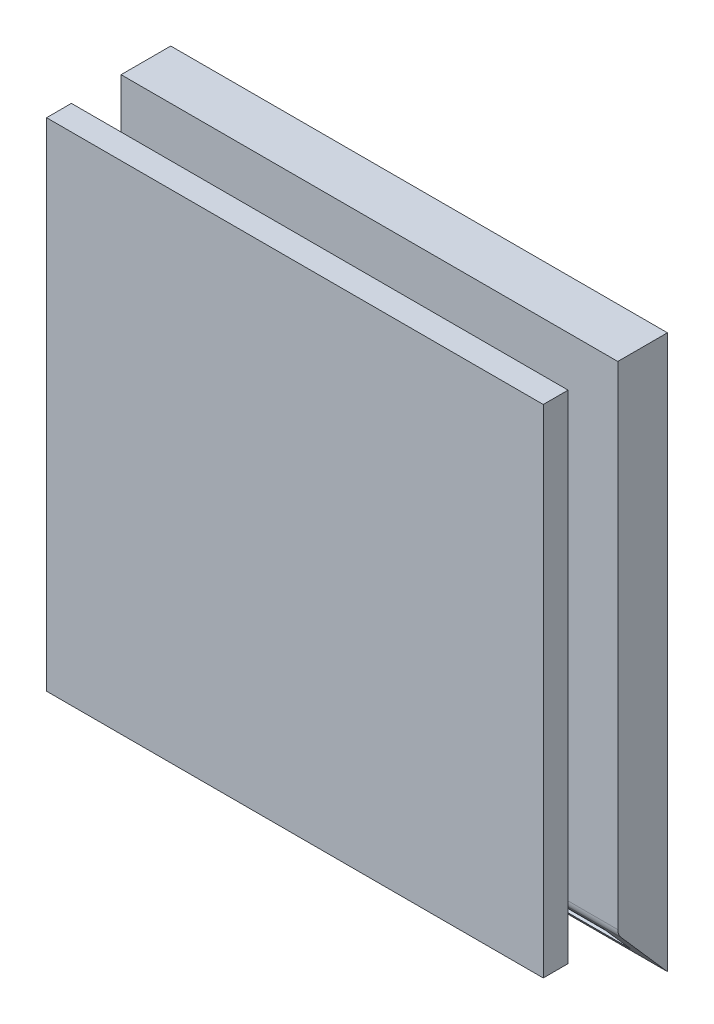
ISO-10303-21;
HEADER;
FILE_DESCRIPTION(('STEP AP214'),'2;1');
FILE_NAME('part.step','',(''),(''),'','','');
FILE_SCHEMA(('AUTOMOTIVE_DESIGN { 1 0 10303 214 1 1 1 1 }'));
ENDSEC;
DATA;
#1=APPLICATION_CONTEXT('core data for automotive mechanical design processes');
#2=APPLICATION_PROTOCOL_DEFINITION('international standard','automotive_design',2000,#1);
#3=PRODUCT_CONTEXT('',#1,'mechanical');
#4=PRODUCT('Part','Part','',(#3));
#5=PRODUCT_RELATED_PRODUCT_CATEGORY('part','',(#4));
#6=PRODUCT_DEFINITION_FORMATION('','',#4);
#7=PRODUCT_DEFINITION_CONTEXT('part definition',#1,'design');
#8=PRODUCT_DEFINITION('design','',#6,#7);
#9=PRODUCT_DEFINITION_SHAPE('','',#8);
#10=(LENGTH_UNIT() NAMED_UNIT(*) SI_UNIT(.MILLI.,.METRE.));
#11=(NAMED_UNIT(*) PLANE_ANGLE_UNIT() SI_UNIT($,.RADIAN.));
#12=(NAMED_UNIT(*) SI_UNIT($,.STERADIAN.) SOLID_ANGLE_UNIT());
#13=UNCERTAINTY_MEASURE_WITH_UNIT(LENGTH_MEASURE(1.E-05),#10,'distance_accuracy_value','');
#14=(GEOMETRIC_REPRESENTATION_CONTEXT(3) GLOBAL_UNCERTAINTY_ASSIGNED_CONTEXT((#13)) GLOBAL_UNIT_ASSIGNED_CONTEXT((#10,
#11,#12)) REPRESENTATION_CONTEXT('',''));
#15=CARTESIAN_POINT('',(0.,0.,0.));
#16=DIRECTION('',(0.,0.,1.));
#17=DIRECTION('',(1.,0.,0.));
#18=AXIS2_PLACEMENT_3D('',#15,#16,#17);
#19=CARTESIAN_POINT('',(8522.17142691417,-2176.82611696061,50.));
#20=DIRECTION('',(0.,1.,0.));
#21=DIRECTION('',(0.,0.,1.));
#22=AXIS2_PLACEMENT_3D('',#19,#20,#21);
#23=PLANE('',#22);
#24=DIRECTION('',(0.,0.,-1.));
#25=VECTOR('',#24,1.);
#26=CARTESIAN_POINT('',(8682.17142691417,-2176.82611696061,30.));
#27=LINE('',#26,#25);
#28=CARTESIAN_POINT('',(8682.17142691417,-2176.82611696061,40.));
#29=VERTEX_POINT('',#28);
#30=CARTESIAN_POINT('',(8682.17142691417,-2176.82611696061,20.));
#31=VERTEX_POINT('',#30);
#32=EDGE_CURVE('E36',#29,#31,#27,.T.);
#33=ORIENTED_EDGE('',*,*,#32,.T.);
#34=DIRECTION('',(-1.,0.,0.));
#35=VECTOR('',#34,1.);
#36=CARTESIAN_POINT('',(8602.17142691417,-2176.82611696061,20.));
#37=LINE('',#36,#35);
#38=CARTESIAN_POINT('',(8522.17142691417,-2176.82611696061,20.));
#39=VERTEX_POINT('',#38);
#40=EDGE_CURVE('E219',#31,#39,#37,.T.);
#41=ORIENTED_EDGE('',*,*,#40,.T.);
#42=DIRECTION('',(0.,0.,-1.));
#43=VECTOR('',#42,1.);
#44=CARTESIAN_POINT('',(8522.17142691417,-2176.82611696061,30.));
#45=LINE('',#44,#43);
#46=CARTESIAN_POINT('',(8522.17142691417,-2176.82611696061,40.));
#47=VERTEX_POINT('',#46);
#48=EDGE_CURVE('E27',#47,#39,#45,.T.);
#49=ORIENTED_EDGE('',*,*,#48,.F.);
#50=DIRECTION('',(-1.,0.,0.));
#51=VECTOR('',#50,1.);
#52=CARTESIAN_POINT('',(8602.17142691417,-2176.82611696061,40.));
#53=LINE('',#52,#51);
#54=EDGE_CURVE('E10',#29,#47,#53,.T.);
#55=ORIENTED_EDGE('',*,*,#54,.F.);
#56=EDGE_LOOP('',(#33,#41,#49,#55));
#57=FACE_BOUND('',#56,.T.);
#58=ADVANCED_FACE('F16',(#57),#23,.T.);
#59=CARTESIAN_POINT('',(8682.17142691417,-2336.82611696061,50.));
#60=DIRECTION('',(-1.,0.,0.));
#61=DIRECTION('',(0.,0.,1.));
#62=AXIS2_PLACEMENT_3D('',#59,#60,#61);
#63=PLANE('',#62);
#64=DIRECTION('',(0.,0.,-1.));
#65=VECTOR('',#64,1.);
#66=CARTESIAN_POINT('',(8682.17142691417,-2336.82611696061,30.));
#67=LINE('',#66,#65);
#68=CARTESIAN_POINT('',(8682.17142691417,-2336.82611696061,40.));
#69=VERTEX_POINT('',#68);
#70=CARTESIAN_POINT('',(8682.17142691417,-2336.82611696061,20.));
#71=VERTEX_POINT('',#70);
#72=EDGE_CURVE('E305',#69,#71,#67,.T.);
#73=ORIENTED_EDGE('',*,*,#72,.T.);
#74=DIRECTION('',(0.,1.,0.));
#75=VECTOR('',#74,1.);
#76=CARTESIAN_POINT('',(8682.17142691417,-2256.82611696061,20.));
#77=LINE('',#76,#75);
#78=EDGE_CURVE('E309',#71,#31,#77,.T.);
#79=ORIENTED_EDGE('',*,*,#78,.T.);
#80=ORIENTED_EDGE('',*,*,#32,.F.);
#81=DIRECTION('',(0.,1.,0.));
#82=VECTOR('',#81,1.);
#83=CARTESIAN_POINT('',(8682.17142691417,-2256.82611696061,40.));
#84=LINE('',#83,#82);
#85=EDGE_CURVE('E319',#69,#29,#84,.T.);
#86=ORIENTED_EDGE('',*,*,#85,.F.);
#87=EDGE_LOOP('',(#73,#79,#80,#86));
#88=FACE_BOUND('',#87,.T.);
#89=ADVANCED_FACE('F333',(#88),#63,.F.);
#90=CARTESIAN_POINT('',(8682.17142691417,-2336.82611696061,50.));
#91=DIRECTION('',(0.,-1.,0.));
#92=DIRECTION('',(0.,0.,-1.));
#93=AXIS2_PLACEMENT_3D('',#90,#91,#92);
#94=PLANE('',#93);
#95=DIRECTION('',(0.,0.,-1.));
#96=VECTOR('',#95,1.);
#97=CARTESIAN_POINT('',(8522.17142691417,-2336.82611696061,30.));
#98=LINE('',#97,#96);
#99=CARTESIAN_POINT('',(8522.17142691417,-2336.82611696061,40.));
#100=VERTEX_POINT('',#99);
#101=CARTESIAN_POINT('',(8522.17142691417,-2336.82611696061,20.));
#102=VERTEX_POINT('',#101);
#103=EDGE_CURVE('E294',#100,#102,#98,.T.);
#104=ORIENTED_EDGE('',*,*,#103,.T.);
#105=DIRECTION('',(1.,0.,0.));
#106=VECTOR('',#105,1.);
#107=CARTESIAN_POINT('',(8602.17142691417,-2336.82611696061,20.));
#108=LINE('',#107,#106);
#109=EDGE_CURVE('E300',#102,#71,#108,.T.);
#110=ORIENTED_EDGE('',*,*,#109,.T.);
#111=ORIENTED_EDGE('',*,*,#72,.F.);
#112=DIRECTION('',(1.,0.,0.));
#113=VECTOR('',#112,1.);
#114=CARTESIAN_POINT('',(8602.17142691417,-2336.82611696061,40.));
#115=LINE('',#114,#113);
#116=EDGE_CURVE('E310',#100,#69,#115,.T.);
#117=ORIENTED_EDGE('',*,*,#116,.F.);
#118=EDGE_LOOP('',(#104,#110,#111,#117));
#119=FACE_BOUND('',#118,.T.);
#120=ADVANCED_FACE('F344',(#119),#94,.T.);
#121=CARTESIAN_POINT('',(8522.17142691417,-2176.82611696061,50.));
#122=DIRECTION('',(1.,0.,0.));
#123=DIRECTION('',(0.,0.,-1.));
#124=AXIS2_PLACEMENT_3D('',#121,#122,#123);
#125=PLANE('',#124);
#126=ORIENTED_EDGE('',*,*,#48,.T.);
#127=DIRECTION('',(0.,-1.,0.));
#128=VECTOR('',#127,1.);
#129=CARTESIAN_POINT('',(8522.17142691417,-2256.82611696061,20.));
#130=LINE('',#129,#128);
#131=EDGE_CURVE('E233',#39,#102,#130,.T.);
#132=ORIENTED_EDGE('',*,*,#131,.T.);
#133=ORIENTED_EDGE('',*,*,#103,.F.);
#134=DIRECTION('',(0.,-1.,0.));
#135=VECTOR('',#134,1.);
#136=CARTESIAN_POINT('',(8522.17142691417,-2256.82611696061,40.));
#137=LINE('',#136,#135);
#138=EDGE_CURVE('E301',#47,#100,#137,.T.);
#139=ORIENTED_EDGE('',*,*,#138,.F.);
#140=EDGE_LOOP('',(#126,#132,#133,#139));
#141=FACE_BOUND('',#140,.T.);
#142=ADVANCED_FACE('F338',(#141),#125,.F.);
#143=CARTESIAN_POINT('',(0.,0.,40.));
#144=DIRECTION('',(0.,0.,1.));
#145=DIRECTION('',(1.,0.,0.));
#146=AXIS2_PLACEMENT_3D('',#143,#144,#145);
#147=PLANE('',#146);
#148=DIRECTION('',(1.,0.,0.));
#149=VECTOR('',#148,1.);
#150=CARTESIAN_POINT('',(8602.17142691417,-2156.8261169606,40.));
#151=LINE('',#150,#149);
#152=CARTESIAN_POINT('',(8502.17142691417,-2156.8261169606,40.));
#153=VERTEX_POINT('',#152);
#154=CARTESIAN_POINT('',(8702.17142691417,-2156.8261169606,40.));
#155=VERTEX_POINT('',#154);
#156=EDGE_CURVE('E275',#153,#155,#151,.T.);
#157=ORIENTED_EDGE('',*,*,#156,.T.);
#158=DIRECTION('',(0.,1.,0.));
#159=VECTOR('',#158,1.);
#160=CARTESIAN_POINT('',(8702.17142691417,-2256.8261169606,40.));
#161=LINE('',#160,#159);
#162=CARTESIAN_POINT('',(8702.17142691417,-2356.8261169606,40.));
#163=VERTEX_POINT('',#162);
#164=EDGE_CURVE('E284',#163,#155,#161,.T.);
#165=ORIENTED_EDGE('',*,*,#164,.F.);
#166=DIRECTION('',(-1.,0.,0.));
#167=VECTOR('',#166,1.);
#168=CARTESIAN_POINT('',(8602.17142691417,-2356.8261169606,40.));
#169=LINE('',#168,#167);
#170=CARTESIAN_POINT('',(8502.17142691417,-2356.8261169606,40.));
#171=VERTEX_POINT('',#170);
#172=EDGE_CURVE('E260',#163,#171,#169,.T.);
#173=ORIENTED_EDGE('',*,*,#172,.T.);
#174=DIRECTION('',(0.,-1.,0.));
#175=VECTOR('',#174,1.);
#176=CARTESIAN_POINT('',(8502.17142691417,-2256.8261169606,40.));
#177=LINE('',#176,#175);
#178=EDGE_CURVE('E288',#153,#171,#177,.T.);
#179=ORIENTED_EDGE('',*,*,#178,.F.);
#180=EDGE_LOOP('',(#157,#165,#173,#179));
#181=FACE_BOUND('',#180,.T.);
#182=ORIENTED_EDGE('',*,*,#54,.T.);
#183=ORIENTED_EDGE('',*,*,#138,.T.);
#184=ORIENTED_EDGE('',*,*,#116,.T.);
#185=ORIENTED_EDGE('',*,*,#85,.T.);
#186=EDGE_LOOP('',(#182,#183,#184,#185));
#187=FACE_BOUND('',#186,.T.);
#188=ADVANCED_FACE('F342',(#181,#187),#147,.F.);
#189=CARTESIAN_POINT('',(8502.17142691417,-2156.8261169606,0.));
#190=DIRECTION('',(0.,-1.,0.));
#191=DIRECTION('',(0.,0.,-1.));
#192=AXIS2_PLACEMENT_3D('',#189,#190,#191);
#193=PLANE('',#192);
#194=DIRECTION('',(0.,0.,1.));
#195=VECTOR('',#194,1.);
#196=CARTESIAN_POINT('',(8702.17142691417,-2156.8261169606,45.));
#197=LINE('',#196,#195);
#198=CARTESIAN_POINT('',(8702.17142691417,-2156.8261169606,50.));
#199=VERTEX_POINT('',#198);
#200=EDGE_CURVE('E280',#155,#199,#197,.T.);
#201=ORIENTED_EDGE('',*,*,#200,.F.);
#202=ORIENTED_EDGE('',*,*,#156,.F.);
#203=DIRECTION('',(0.,0.,1.));
#204=VECTOR('',#203,1.);
#205=CARTESIAN_POINT('',(8502.17142691417,-2156.8261169606,45.));
#206=LINE('',#205,#204);
#207=CARTESIAN_POINT('',(8502.17142691417,-2156.8261169606,50.));
#208=VERTEX_POINT('',#207);
#209=EDGE_CURVE('E272',#153,#208,#206,.T.);
#210=ORIENTED_EDGE('',*,*,#209,.T.);
#211=DIRECTION('',(-1.,0.,0.));
#212=VECTOR('',#211,1.);
#213=CARTESIAN_POINT('',(8602.17142691417,-2156.8261169606,50.));
#214=LINE('',#213,#212);
#215=EDGE_CURVE('E276',#199,#208,#214,.T.);
#216=ORIENTED_EDGE('',*,*,#215,.F.);
#217=EDGE_LOOP('',(#201,#202,#210,#216));
#218=FACE_BOUND('',#217,.T.);
#219=ADVANCED_FACE('F385',(#218),#193,.F.);
#220=CARTESIAN_POINT('',(8502.17142691417,-2156.8261169606,0.));
#221=DIRECTION('',(-1.,0.,0.));
#222=DIRECTION('',(0.,0.,1.));
#223=AXIS2_PLACEMENT_3D('',#220,#221,#222);
#224=PLANE('',#223);
#225=ORIENTED_EDGE('',*,*,#178,.T.);
#226=DIRECTION('',(0.,0.,1.));
#227=VECTOR('',#226,1.);
#228=CARTESIAN_POINT('',(8502.17142691417,-2356.8261169606,45.));
#229=LINE('',#228,#227);
#230=CARTESIAN_POINT('',(8502.17142691417,-2356.8261169606,50.));
#231=VERTEX_POINT('',#230);
#232=EDGE_CURVE('E265',#171,#231,#229,.T.);
#233=ORIENTED_EDGE('',*,*,#232,.T.);
#234=DIRECTION('',(0.,-1.,0.));
#235=VECTOR('',#234,1.);
#236=CARTESIAN_POINT('',(8502.17142691417,-2256.8261169606,50.));
#237=LINE('',#236,#235);
#238=EDGE_CURVE('E268',#208,#231,#237,.T.);
#239=ORIENTED_EDGE('',*,*,#238,.F.);
#240=ORIENTED_EDGE('',*,*,#209,.F.);
#241=EDGE_LOOP('',(#225,#233,#239,#240));
#242=FACE_BOUND('',#241,.T.);
#243=ADVANCED_FACE('F394',(#242),#224,.T.);
#244=CARTESIAN_POINT('',(8702.17142691417,-2356.8261169606,0.));
#245=DIRECTION('',(0.,1.,0.));
#246=DIRECTION('',(0.,0.,1.));
#247=AXIS2_PLACEMENT_3D('',#244,#245,#246);
#248=PLANE('',#247);
#249=ORIENTED_EDGE('',*,*,#232,.F.);
#250=ORIENTED_EDGE('',*,*,#172,.F.);
#251=DIRECTION('',(0.,0.,1.));
#252=VECTOR('',#251,1.);
#253=CARTESIAN_POINT('',(8702.17142691417,-2356.8261169606,45.));
#254=LINE('',#253,#252);
#255=CARTESIAN_POINT('',(8702.17142691417,-2356.8261169606,50.));
#256=VERTEX_POINT('',#255);
#257=EDGE_CURVE('E257',#163,#256,#254,.T.);
#258=ORIENTED_EDGE('',*,*,#257,.T.);
#259=DIRECTION('',(1.,0.,0.));
#260=VECTOR('',#259,1.);
#261=CARTESIAN_POINT('',(8602.17142691417,-2356.8261169606,50.));
#262=LINE('',#261,#260);
#263=EDGE_CURVE('E261',#231,#256,#262,.T.);
#264=ORIENTED_EDGE('',*,*,#263,.F.);
#265=EDGE_LOOP('',(#249,#250,#258,#264));
#266=FACE_BOUND('',#265,.T.);
#267=ADVANCED_FACE('F403',(#266),#248,.F.);
#268=CARTESIAN_POINT('',(8702.17142691417,-2356.8261169606,0.));
#269=DIRECTION('',(1.,0.,0.));
#270=DIRECTION('',(0.,0.,-1.));
#271=AXIS2_PLACEMENT_3D('',#268,#269,#270);
#272=PLANE('',#271);
#273=ORIENTED_EDGE('',*,*,#164,.T.);
#274=ORIENTED_EDGE('',*,*,#200,.T.);
#275=DIRECTION('',(0.,1.,0.));
#276=VECTOR('',#275,1.);
#277=CARTESIAN_POINT('',(8702.17142691417,-2256.8261169606,50.));
#278=LINE('',#277,#276);
#279=EDGE_CURVE('E251',#256,#199,#278,.T.);
#280=ORIENTED_EDGE('',*,*,#279,.F.);
#281=ORIENTED_EDGE('',*,*,#257,.F.);
#282=EDGE_LOOP('',(#273,#274,#280,#281));
#283=FACE_BOUND('',#282,.T.);
#284=ADVANCED_FACE('F412',(#283),#272,.T.);
#285=CARTESIAN_POINT('',(0.,0.,50.));
#286=DIRECTION('',(0.,0.,1.));
#287=DIRECTION('',(1.,0.,0.));
#288=AXIS2_PLACEMENT_3D('',#285,#286,#287);
#289=PLANE('',#288);
#290=ORIENTED_EDGE('',*,*,#215,.T.);
#291=ORIENTED_EDGE('',*,*,#238,.T.);
#292=ORIENTED_EDGE('',*,*,#263,.T.);
#293=ORIENTED_EDGE('',*,*,#279,.T.);
#294=EDGE_LOOP('',(#290,#291,#292,#293));
#295=FACE_BOUND('',#294,.T.);
#296=ADVANCED_FACE('F421',(#295),#289,.T.);
#297=CARTESIAN_POINT('',(0.,0.,0.));
#298=DIRECTION('',(0.,0.,1.));
#299=DIRECTION('',(1.,0.,0.));
#300=AXIS2_PLACEMENT_3D('',#297,#298,#299);
#301=PLANE('',#300);
#302=DIRECTION('',(-1.,0.,0.));
#303=VECTOR('',#302,1.);
#304=CARTESIAN_POINT('',(8602.17142691417,-2379.6068227965,0.));
#305=LINE('',#304,#303);
#306=CARTESIAN_POINT('',(8702.17142691417,-2379.6068227965,0.));
#307=VERTEX_POINT('',#306);
#308=CARTESIAN_POINT('',(8502.17142691417,-2379.6068227965,0.));
#309=VERTEX_POINT('',#308);
#310=EDGE_CURVE('E195',#307,#309,#305,.T.);
#311=ORIENTED_EDGE('',*,*,#310,.T.);
#312=DIRECTION('',(0.,-1.,0.));
#313=VECTOR('',#312,1.);
#314=CARTESIAN_POINT('',(8502.17142691417,-2268.21646987855,0.));
#315=LINE('',#314,#313);
#316=CARTESIAN_POINT('',(8502.17142691417,-2156.8261169606,0.));
#317=VERTEX_POINT('',#316);
#318=EDGE_CURVE('E237',#317,#309,#315,.T.);
#319=ORIENTED_EDGE('',*,*,#318,.F.);
#320=DIRECTION('',(-1.,0.,0.));
#321=VECTOR('',#320,1.);
#322=CARTESIAN_POINT('',(8602.17142691417,-2156.8261169606,0.));
#323=LINE('',#322,#321);
#324=CARTESIAN_POINT('',(8702.17142691417,-2156.8261169606,0.));
#325=VERTEX_POINT('',#324);
#326=EDGE_CURVE('E243',#325,#317,#323,.T.);
#327=ORIENTED_EDGE('',*,*,#326,.F.);
#328=DIRECTION('',(0.,1.,0.));
#329=VECTOR('',#328,1.);
#330=CARTESIAN_POINT('',(8702.17142691417,-2268.21646987855,0.));
#331=LINE('',#330,#329);
#332=EDGE_CURVE('E247',#307,#325,#331,.T.);
#333=ORIENTED_EDGE('',*,*,#332,.F.);
#334=EDGE_LOOP('',(#311,#319,#327,#333));
#335=FACE_BOUND('',#334,.T.);
#336=ADVANCED_FACE('F430',(#335),#301,.F.);
#337=CARTESIAN_POINT('',(8502.17142691417,-2156.8261169606,0.));
#338=DIRECTION('',(0.,-1.,0.));
#339=DIRECTION('',(0.,0.,-1.));
#340=AXIS2_PLACEMENT_3D('',#337,#338,#339);
#341=PLANE('',#340);
#342=DIRECTION('',(0.,0.,1.));
#343=VECTOR('',#342,1.);
#344=CARTESIAN_POINT('',(8502.17142691417,-2156.8261169606,10.));
#345=LINE('',#344,#343);
#346=CARTESIAN_POINT('',(8502.17142691417,-2156.8261169606,20.));
#347=VERTEX_POINT('',#346);
#348=EDGE_CURVE('E215',#317,#347,#345,.T.);
#349=ORIENTED_EDGE('',*,*,#348,.T.);
#350=DIRECTION('',(1.,0.,0.));
#351=VECTOR('',#350,1.);
#352=CARTESIAN_POINT('',(8602.17142691417,-2156.8261169606,20.));
#353=LINE('',#352,#351);
#354=CARTESIAN_POINT('',(8702.17142691417,-2156.8261169606,20.));
#355=VERTEX_POINT('',#354);
#356=EDGE_CURVE('E230',#347,#355,#353,.T.);
#357=ORIENTED_EDGE('',*,*,#356,.T.);
#358=DIRECTION('',(0.,0.,1.));
#359=VECTOR('',#358,1.);
#360=CARTESIAN_POINT('',(8702.17142691417,-2156.8261169606,10.));
#361=LINE('',#360,#359);
#362=EDGE_CURVE('E229',#325,#355,#361,.T.);
#363=ORIENTED_EDGE('',*,*,#362,.F.);
#364=ORIENTED_EDGE('',*,*,#326,.T.);
#365=EDGE_LOOP('',(#349,#357,#363,#364));
#366=FACE_BOUND('',#365,.T.);
#367=ADVANCED_FACE('F439',(#366),#341,.F.);
#368=CARTESIAN_POINT('',(0.,0.,20.));
#369=DIRECTION('',(0.,0.,1.));
#370=DIRECTION('',(1.,0.,0.));
#371=AXIS2_PLACEMENT_3D('',#368,#369,#370);
#372=PLANE('',#371);
#373=DIRECTION('',(-1.,0.,0.));
#374=VECTOR('',#373,1.);
#375=CARTESIAN_POINT('',(8602.17142691417,-2354.94270285808,20.));
#376=LINE('',#375,#374);
#377=CARTESIAN_POINT('',(8702.17142691417,-2354.94270285808,20.));
#378=VERTEX_POINT('',#377);
#379=CARTESIAN_POINT('',(8502.17142691417,-2354.94270285808,20.));
#380=VERTEX_POINT('',#379);
#381=EDGE_CURVE('E225',#378,#380,#376,.T.);
#382=ORIENTED_EDGE('',*,*,#381,.F.);
#383=DIRECTION('',(0.,1.,0.));
#384=VECTOR('',#383,1.);
#385=CARTESIAN_POINT('',(8702.17142691417,-2255.88440990934,20.));
#386=LINE('',#385,#384);
#387=EDGE_CURVE('E200',#378,#355,#386,.T.);
#388=ORIENTED_EDGE('',*,*,#387,.T.);
#389=ORIENTED_EDGE('',*,*,#356,.F.);
#390=DIRECTION('',(0.,-1.,0.));
#391=VECTOR('',#390,1.);
#392=CARTESIAN_POINT('',(8502.17142691417,-2255.88440990934,20.));
#393=LINE('',#392,#391);
#394=EDGE_CURVE('E209',#347,#380,#393,.T.);
#395=ORIENTED_EDGE('',*,*,#394,.T.);
#396=EDGE_LOOP('',(#382,#388,#389,#395));
#397=FACE_BOUND('',#396,.T.);
#398=ORIENTED_EDGE('',*,*,#131,.F.);
#399=ORIENTED_EDGE('',*,*,#40,.F.);
#400=ORIENTED_EDGE('',*,*,#78,.F.);
#401=ORIENTED_EDGE('',*,*,#109,.F.);
#402=EDGE_LOOP('',(#398,#399,#400,#401));
#403=FACE_BOUND('',#402,.T.);
#404=ADVANCED_FACE('F336',(#397,#403),#372,.T.);
#405=CARTESIAN_POINT('',(8502.17142691417,-2156.8261169606,0.));
#406=DIRECTION('',(-1.,0.,0.));
#407=DIRECTION('',(0.,0.,1.));
#408=AXIS2_PLACEMENT_3D('',#405,#406,#407);
#409=PLANE('',#408);
#410=CARTESIAN_POINT('',(8502.17142691417,-2354.94270285808,15.));
#411=DIRECTION('',(1.,0.,0.));
#412=DIRECTION('',(0.,0.,1.));
#413=AXIS2_PLACEMENT_3D('',#410,#411,#412);
#414=CIRCLE('',#413,5.);
#415=CARTESIAN_POINT('',(8502.17142691417,-2358.24146927079,18.7574113634707));
#416=VERTEX_POINT('',#415);
#417=EDGE_CURVE('E214',#380,#416,#414,.T.);
#418=ORIENTED_EDGE('',*,*,#417,.F.);
#419=ORIENTED_EDGE('',*,*,#394,.F.);
#420=ORIENTED_EDGE('',*,*,#348,.F.);
#421=ORIENTED_EDGE('',*,*,#318,.T.);
#422=DIRECTION('',(0.,-0.751482272694116,-0.659753282543169));
#423=VECTOR('',#422,1.);
#424=CARTESIAN_POINT('',(8502.17142691417,-2368.92414603365,9.37870568173534));
#425=LINE('',#424,#423);
#426=EDGE_CURVE('E210',#416,#309,#425,.T.);
#427=ORIENTED_EDGE('',*,*,#426,.F.);
#428=EDGE_LOOP('',(#418,#419,#420,#421,#427));
#429=FACE_BOUND('',#428,.T.);
#430=ADVANCED_FACE('F456',(#429),#409,.T.);
#431=CARTESIAN_POINT('',(8702.17142691417,-2356.8261169606,0.));
#432=DIRECTION('',(1.,0.,0.));
#433=DIRECTION('',(0.,0.,-1.));
#434=AXIS2_PLACEMENT_3D('',#431,#432,#433);
#435=PLANE('',#434);
#436=CARTESIAN_POINT('',(8702.17142691417,-2354.94270285808,15.));
#437=DIRECTION('',(-1.,0.,0.));
#438=DIRECTION('',(0.,0.,-1.));
#439=AXIS2_PLACEMENT_3D('',#436,#437,#438);
#440=CIRCLE('',#439,5.);
#441=CARTESIAN_POINT('',(8702.17142691417,-2358.24146927079,18.7574113634707));
#442=VERTEX_POINT('',#441);
#443=EDGE_CURVE('E205',#442,#378,#440,.T.);
#444=ORIENTED_EDGE('',*,*,#443,.F.);
#445=DIRECTION('',(0.,-0.751482272694116,-0.659753282543169));
#446=VECTOR('',#445,1.);
#447=CARTESIAN_POINT('',(8702.17142691417,-2368.92414603365,9.37870568173534));
#448=LINE('',#447,#446);
#449=EDGE_CURVE('E201',#442,#307,#448,.T.);
#450=ORIENTED_EDGE('',*,*,#449,.T.);
#451=ORIENTED_EDGE('',*,*,#332,.T.);
#452=ORIENTED_EDGE('',*,*,#362,.T.);
#453=ORIENTED_EDGE('',*,*,#387,.F.);
#454=EDGE_LOOP('',(#444,#450,#451,#452,#453));
#455=FACE_BOUND('',#454,.T.);
#456=ADVANCED_FACE('F465',(#455),#435,.T.);
#457=CARTESIAN_POINT('',(8602.17142691417,-2354.94270285808,15.));
#458=DIRECTION('',(-1.,0.,0.));
#459=DIRECTION('',(0.,0.,1.));
#460=AXIS2_PLACEMENT_3D('',#457,#458,#459);
#461=CYLINDRICAL_SURFACE('',#460,5.);
#462=ORIENTED_EDGE('',*,*,#381,.T.);
#463=ORIENTED_EDGE('',*,*,#417,.T.);
#464=DIRECTION('',(-1.,0.,0.));
#465=VECTOR('',#464,1.);
#466=CARTESIAN_POINT('',(8602.17142691417,-2358.24146927079,18.7574113634706));
#467=LINE('',#466,#465);
#468=EDGE_CURVE('E196',#442,#416,#467,.T.);
#469=ORIENTED_EDGE('',*,*,#468,.F.);
#470=ORIENTED_EDGE('',*,*,#443,.T.);
#471=EDGE_LOOP('',(#462,#463,#469,#470));
#472=FACE_BOUND('',#471,.T.);
#473=ADVANCED_FACE('F474',(#472),#461,.T.);
#474=CARTESIAN_POINT('',(8702.17142691417,-2356.8261169606,20.));
#475=DIRECTION('',(0.,0.65975328254317,-0.751482272694115));
#476=DIRECTION('',(0.,0.751482272694115,0.65975328254317));
#477=AXIS2_PLACEMENT_3D('',#474,#475,#476);
#478=PLANE('',#477);
#479=ORIENTED_EDGE('',*,*,#449,.F.);
#480=ORIENTED_EDGE('',*,*,#468,.T.);
#481=ORIENTED_EDGE('',*,*,#426,.T.);
#482=ORIENTED_EDGE('',*,*,#310,.F.);
#483=EDGE_LOOP('',(#479,#480,#481,#482));
#484=FACE_BOUND('',#483,.T.);
#485=DIRECTION('',(-1.,0.,0.));
#486=VECTOR('',#485,1.);
#487=CARTESIAN_POINT('',(8655.36392299952,-2362.91603264453,14.6534442542738));
#488=LINE('',#487,#486);
#489=CARTESIAN_POINT('',(8691.24212536709,-2362.91603264453,14.6534442542738));
#490=VERTEX_POINT('',#489);
#491=CARTESIAN_POINT('',(8619.48572063195,-2362.91603264453,14.6534442542736));
#492=VERTEX_POINT('',#491);
#493=EDGE_CURVE('E183',#490,#492,#488,.T.);
#494=ORIENTED_EDGE('',*,*,#493,.F.);
#495=DIRECTION('',(0.,0.751482272694115,0.65975328254317));
#496=VECTOR('',#495,1.);
#497=CARTESIAN_POINT('',(8691.24212536709,-2369.08236518915,9.23979940144847));
#498=LINE('',#497,#496);
#499=CARTESIAN_POINT('',(8691.24212536709,-2375.24869773376,3.82615454862321));
#500=VERTEX_POINT('',#499);
#501=EDGE_CURVE('E185',#500,#490,#498,.T.);
#502=ORIENTED_EDGE('',*,*,#501,.F.);
#503=DIRECTION('',(1.,0.,0.));
#504=VECTOR('',#503,1.);
#505=CARTESIAN_POINT('',(8655.36392299952,-2375.24869773376,3.82615454862315));
#506=LINE('',#505,#504);
#507=CARTESIAN_POINT('',(8619.48572063195,-2375.24869773376,3.82615454862308));
#508=VERTEX_POINT('',#507);
#509=EDGE_CURVE('E147',#508,#500,#506,.T.);
#510=ORIENTED_EDGE('',*,*,#509,.F.);
#511=DIRECTION('',(0.,-0.751482272694115,-0.65975328254317));
#512=VECTOR('',#511,1.);
#513=CARTESIAN_POINT('',(8619.48572063195,-2369.08236518915,9.23979940144839));
#514=LINE('',#513,#512);
#515=EDGE_CURVE('E188',#492,#508,#514,.T.);
#516=ORIENTED_EDGE('',*,*,#515,.F.);
#517=EDGE_LOOP('',(#494,#502,#510,#516));
#518=FACE_BOUND('',#517,.T.);
#519=ADVANCED_FACE('F483',(#484,#518),#478,.F.);
#520=CARTESIAN_POINT('',(8619.48572063195,-2362.91603264453,14.6534442542736));
#521=DIRECTION('',(1.,0.,0.));
#522=DIRECTION('',(0.,0.,-1.));
#523=AXIS2_PLACEMENT_3D('',#520,#521,#522);
#524=PLANE('',#523);
#525=DIRECTION('',(0.,-0.751482272694117,-0.659753282543168));
#526=VECTOR('',#525,1.);
#527=CARTESIAN_POINT('',(8619.48572063195,-2368.4226119066,8.48831712875438));
#528=LINE('',#527,#526);
#529=CARTESIAN_POINT('',(8619.48572063195,-2362.25627936199,13.9019619815795));
#530=VERTEX_POINT('',#529);
#531=CARTESIAN_POINT('',(8619.48572063195,-2374.58894445121,3.07467227592906));
#532=VERTEX_POINT('',#531);
#533=EDGE_CURVE('E155',#530,#532,#528,.T.);
#534=ORIENTED_EDGE('',*,*,#533,.F.);
#535=DIRECTION('',(0.,0.659753282543206,-0.751482272694083));
#536=VECTOR('',#535,1.);
#537=CARTESIAN_POINT('',(8619.48572063195,-2362.58615600326,14.2777031179266));
#538=LINE('',#537,#536);
#539=EDGE_CURVE('E170',#492,#530,#538,.T.);
#540=ORIENTED_EDGE('',*,*,#539,.F.);
#541=ORIENTED_EDGE('',*,*,#515,.T.);
#542=DIRECTION('',(0.,0.659753282543207,-0.751482272694083));
#543=VECTOR('',#542,1.);
#544=CARTESIAN_POINT('',(8619.48572063195,-2374.91882109248,3.45041341227606));
#545=LINE('',#544,#543);
#546=EDGE_CURVE('E157',#508,#532,#545,.T.);
#547=ORIENTED_EDGE('',*,*,#546,.T.);
#548=EDGE_LOOP('',(#534,#540,#541,#547));
#549=FACE_BOUND('',#548,.T.);
#550=ADVANCED_FACE('F184',(#549),#524,.T.);
#551=CARTESIAN_POINT('',(8619.48572063195,-2362.91603264453,14.6534442542738));
#552=DIRECTION('',(0.,0.751482272694115,0.65975328254317));
#553=DIRECTION('',(0.,-0.65975328254317,0.751482272694115));
#554=AXIS2_PLACEMENT_3D('',#551,#552,#553);
#555=PLANE('',#554);
#556=DIRECTION('',(-1.,0.,0.));
#557=VECTOR('',#556,1.);
#558=CARTESIAN_POINT('',(8655.36392299952,-2362.25627936199,13.9019619815798));
#559=LINE('',#558,#557);
#560=CARTESIAN_POINT('',(8691.24212536709,-2362.25627936199,13.9019619815797));
#561=VERTEX_POINT('',#560);
#562=EDGE_CURVE('E172',#561,#530,#559,.T.);
#563=ORIENTED_EDGE('',*,*,#562,.F.);
#564=DIRECTION('',(0.,0.659753282543139,-0.751482272694143));
#565=VECTOR('',#564,1.);
#566=CARTESIAN_POINT('',(8691.24212536709,-2362.58615600326,14.2777031179268));
#567=LINE('',#566,#565);
#568=EDGE_CURVE('E135',#490,#561,#567,.T.);
#569=ORIENTED_EDGE('',*,*,#568,.F.);
#570=ORIENTED_EDGE('',*,*,#493,.T.);
#571=ORIENTED_EDGE('',*,*,#539,.T.);
#572=EDGE_LOOP('',(#563,#569,#570,#571));
#573=FACE_BOUND('',#572,.T.);
#574=ADVANCED_FACE('F179',(#573),#555,.F.);
#575=CARTESIAN_POINT('',(8691.24212536709,-2375.24869773376,3.82615454862321));
#576=DIRECTION('',(0.,-0.751482272694115,-0.65975328254317));
#577=DIRECTION('',(0.,0.65975328254317,-0.751482272694115));
#578=AXIS2_PLACEMENT_3D('',#575,#576,#577);
#579=PLANE('',#578);
#580=DIRECTION('',(1.,0.,0.));
#581=VECTOR('',#580,1.);
#582=CARTESIAN_POINT('',(8655.36392299952,-2374.58894445121,3.07467227592914));
#583=LINE('',#582,#581);
#584=CARTESIAN_POINT('',(8691.24212536709,-2374.58894445121,3.07467227592906));
#585=VERTEX_POINT('',#584);
#586=EDGE_CURVE('E146',#532,#585,#583,.T.);
#587=ORIENTED_EDGE('',*,*,#586,.F.);
#588=ORIENTED_EDGE('',*,*,#546,.F.);
#589=ORIENTED_EDGE('',*,*,#509,.T.);
#590=DIRECTION('',(0.,0.659753282543141,-0.751482272694141));
#591=VECTOR('',#590,1.);
#592=CARTESIAN_POINT('',(8691.24212536709,-2374.91882109248,3.45041341227617));
#593=LINE('',#592,#591);
#594=EDGE_CURVE('E142',#500,#585,#593,.T.);
#595=ORIENTED_EDGE('',*,*,#594,.T.);
#596=EDGE_LOOP('',(#587,#588,#589,#595));
#597=FACE_BOUND('',#596,.T.);
#598=ADVANCED_FACE('F144',(#597),#579,.F.);
#599=CARTESIAN_POINT('',(0.,-1035.12216405558,1179.04067617828));
#600=DIRECTION('',(0.,-0.65975328254317,0.751482272694115));
#601=DIRECTION('',(0.,-0.751482272694115,-0.65975328254317));
#602=AXIS2_PLACEMENT_3D('',#599,#600,#601);
#603=PLANE('',#602);
#604=ORIENTED_EDGE('',*,*,#562,.T.);
#605=ORIENTED_EDGE('',*,*,#533,.T.);
#606=ORIENTED_EDGE('',*,*,#586,.T.);
#607=DIRECTION('',(0.,0.751482272694115,0.65975328254317));
#608=VECTOR('',#607,1.);
#609=CARTESIAN_POINT('',(8691.24212536709,-2368.4226119066,8.48831712875438));
#610=LINE('',#609,#608);
#611=EDGE_CURVE('E20',#585,#561,#610,.T.);
#612=ORIENTED_EDGE('',*,*,#611,.T.);
#613=EDGE_LOOP('',(#604,#605,#606,#612));
#614=FACE_BOUND('',#613,.T.);
#615=ADVANCED_FACE('F153',(#614),#603,.T.);
#616=CARTESIAN_POINT('',(8691.24212536709,-2375.24869773376,3.82615454862321));
#617=DIRECTION('',(-1.,0.,0.));
#618=DIRECTION('',(0.,0.,1.));
#619=AXIS2_PLACEMENT_3D('',#616,#617,#618);
#620=PLANE('',#619);
#621=ORIENTED_EDGE('',*,*,#611,.F.);
#622=ORIENTED_EDGE('',*,*,#594,.F.);
#623=ORIENTED_EDGE('',*,*,#501,.T.);
#624=ORIENTED_EDGE('',*,*,#568,.T.);
#625=EDGE_LOOP('',(#621,#622,#623,#624));
#626=FACE_BOUND('',#625,.T.);
#627=ADVANCED_FACE('F18',(#626),#620,.T.);
#628=CLOSED_SHELL('',(#58,#89,#120,#142,#188,#219,#243,#267,#284,#296,#336,#367,#404,#430,#456,
#473,#519,#550,#574,#598,#615,#627));
#629=MANIFOLD_SOLID_BREP('B1',#628);
#630=ADVANCED_BREP_SHAPE_REPRESENTATION('',(#18,#629),#14);
#631=SHAPE_DEFINITION_REPRESENTATION(#9,#630);
ENDSEC;
END-ISO-10303-21;
